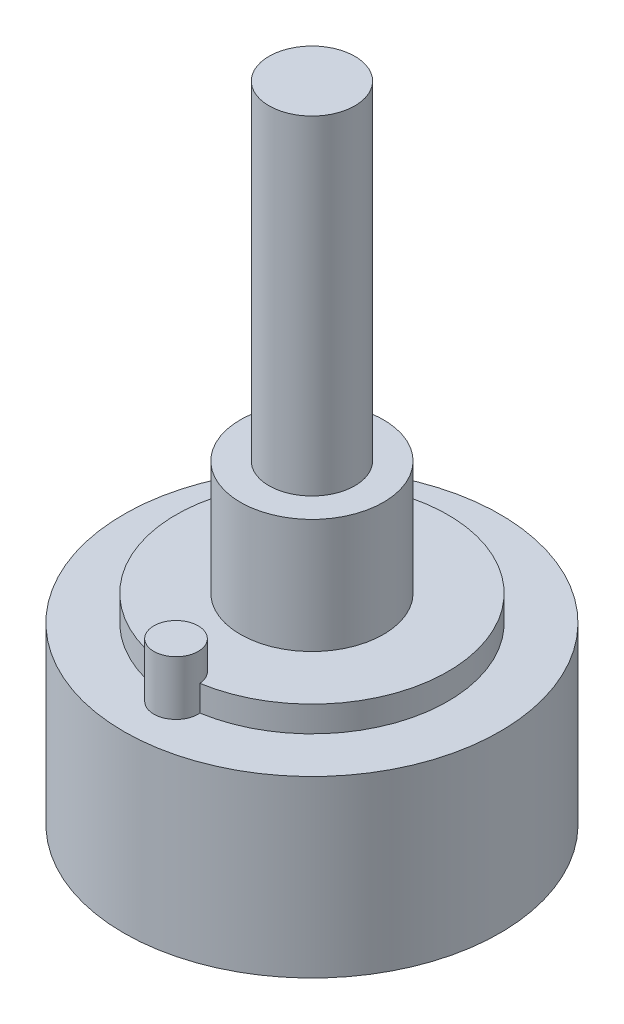
ISO-10303-21;
HEADER;
FILE_DESCRIPTION(('STEP AP214'),'2;1');
FILE_NAME('part.step','',(''),(''),'','','');
FILE_SCHEMA(('AUTOMOTIVE_DESIGN { 1 0 10303 214 1 1 1 1 }'));
ENDSEC;
DATA;
#1=APPLICATION_CONTEXT('core data for automotive mechanical design processes');
#2=APPLICATION_PROTOCOL_DEFINITION('international standard','automotive_design',2000,#1);
#3=PRODUCT_CONTEXT('',#1,'mechanical');
#4=PRODUCT('Part','Part','',(#3));
#5=PRODUCT_RELATED_PRODUCT_CATEGORY('part','',(#4));
#6=PRODUCT_DEFINITION_FORMATION('','',#4);
#7=PRODUCT_DEFINITION_CONTEXT('part definition',#1,'design');
#8=PRODUCT_DEFINITION('design','',#6,#7);
#9=PRODUCT_DEFINITION_SHAPE('','',#8);
#10=(LENGTH_UNIT() NAMED_UNIT(*) SI_UNIT(.MILLI.,.METRE.));
#11=(NAMED_UNIT(*) PLANE_ANGLE_UNIT() SI_UNIT($,.RADIAN.));
#12=(NAMED_UNIT(*) SI_UNIT($,.STERADIAN.) SOLID_ANGLE_UNIT());
#13=UNCERTAINTY_MEASURE_WITH_UNIT(LENGTH_MEASURE(1.E-05),#10,'distance_accuracy_value','');
#14=(GEOMETRIC_REPRESENTATION_CONTEXT(3) GLOBAL_UNCERTAINTY_ASSIGNED_CONTEXT((#13)) GLOBAL_UNIT_ASSIGNED_CONTEXT((#10,
#11,#12)) REPRESENTATION_CONTEXT('',''));
#15=CARTESIAN_POINT('',(0.,0.,0.));
#16=DIRECTION('',(0.,0.,1.));
#17=DIRECTION('',(1.,0.,0.));
#18=AXIS2_PLACEMENT_3D('',#15,#16,#17);
#19=CARTESIAN_POINT('',(0.,14.,0.));
#20=DIRECTION('',(0.,1.,0.));
#21=DIRECTION('',(0.,0.,1.));
#22=AXIS2_PLACEMENT_3D('',#19,#20,#21);
#23=PLANE('',#22);
#24=CARTESIAN_POINT('',(0.,14.,0.));
#25=DIRECTION('',(0.,1.,0.));
#26=DIRECTION('',(0.,0.,1.));
#27=AXIS2_PLACEMENT_3D('',#24,#25,#26);
#28=CIRCLE('',#27,5.);
#29=CARTESIAN_POINT('',(0.,14.,5.));
#30=VERTEX_POINT('',#29);
#31=EDGE_CURVE('E80',#30,#30,#28,.T.);
#32=ORIENTED_EDGE('',*,*,#31,.F.);
#33=EDGE_LOOP('',(#32));
#34=FACE_BOUND('',#33,.T.);
#35=CARTESIAN_POINT('',(0.,14.,0.));
#36=DIRECTION('',(0.,1.,0.));
#37=DIRECTION('',(0.,0.,1.));
#38=AXIS2_PLACEMENT_3D('',#35,#36,#37);
#39=CIRCLE('',#38,9.5);
#40=CARTESIAN_POINT('',(1.54483366839909,14.,9.37355263157895));
#41=VERTEX_POINT('',#40);
#42=CARTESIAN_POINT('',(-1.54483366839909,14.,9.37355263157895));
#43=VERTEX_POINT('',#42);
#44=EDGE_CURVE('E58',#41,#43,#39,.T.);
#45=ORIENTED_EDGE('',*,*,#44,.T.);
#46=CARTESIAN_POINT('',(0.,14.,9.5));
#47=DIRECTION('',(0.,1.,0.));
#48=DIRECTION('',(0.,0.,1.));
#49=AXIS2_PLACEMENT_3D('',#46,#47,#48);
#50=CIRCLE('',#49,1.55);
#51=EDGE_CURVE('E66',#43,#41,#50,.F.);
#52=ORIENTED_EDGE('',*,*,#51,.T.);
#53=EDGE_LOOP('',(#45,#52));
#54=FACE_BOUND('',#53,.T.);
#55=ADVANCED_FACE('F32',(#34,#54),#23,.T.);
#56=CARTESIAN_POINT('',(0.,12.2,0.));
#57=DIRECTION('',(0.,1.,0.));
#58=DIRECTION('',(0.,0.,1.));
#59=AXIS2_PLACEMENT_3D('',#56,#57,#58);
#60=PLANE('',#59);
#61=CARTESIAN_POINT('',(0.,12.2,0.));
#62=DIRECTION('',(0.,1.,0.));
#63=DIRECTION('',(0.,0.,1.));
#64=AXIS2_PLACEMENT_3D('',#61,#62,#63);
#65=CIRCLE('',#64,13.15);
#66=CARTESIAN_POINT('',(0.,12.2,13.15));
#67=VERTEX_POINT('',#66);
#68=EDGE_CURVE('E72',#67,#67,#65,.T.);
#69=ORIENTED_EDGE('',*,*,#68,.T.);
#70=EDGE_LOOP('',(#69));
#71=FACE_BOUND('',#70,.T.);
#72=CARTESIAN_POINT('',(0.,12.2,0.));
#73=DIRECTION('',(0.,1.,0.));
#74=DIRECTION('',(0.,0.,1.));
#75=AXIS2_PLACEMENT_3D('',#72,#73,#74);
#76=CIRCLE('',#75,9.5);
#77=CARTESIAN_POINT('',(1.54483366839909,12.2,9.37355263157895));
#78=VERTEX_POINT('',#77);
#79=CARTESIAN_POINT('',(-1.54483366839909,12.2,9.37355263157895));
#80=VERTEX_POINT('',#79);
#81=EDGE_CURVE('E64',#78,#80,#76,.T.);
#82=ORIENTED_EDGE('',*,*,#81,.F.);
#83=CARTESIAN_POINT('',(0.,12.2,9.5));
#84=DIRECTION('',(0.,1.,0.));
#85=DIRECTION('',(0.,0.,1.));
#86=AXIS2_PLACEMENT_3D('',#83,#84,#85);
#87=CIRCLE('',#86,1.55);
#88=EDGE_CURVE('E46',#80,#78,#87,.T.);
#89=ORIENTED_EDGE('',*,*,#88,.F.);
#90=EDGE_LOOP('',(#82,#89));
#91=FACE_BOUND('',#90,.T.);
#92=ADVANCED_FACE('F108',(#71,#91),#60,.T.);
#93=CARTESIAN_POINT('',(0.,14.,0.));
#94=DIRECTION('',(0.,-1.,0.));
#95=DIRECTION('',(0.,0.,-1.));
#96=AXIS2_PLACEMENT_3D('',#93,#94,#95);
#97=CYLINDRICAL_SURFACE('',#96,9.5);
#98=DIRECTION('',(0.,-1.,0.));
#99=VECTOR('',#98,1.);
#100=CARTESIAN_POINT('',(-1.54483366839909,14.1,9.37355263157895));
#101=LINE('',#100,#99);
#102=EDGE_CURVE('E11',#43,#80,#101,.T.);
#103=ORIENTED_EDGE('',*,*,#102,.F.);
#104=ORIENTED_EDGE('',*,*,#44,.F.);
#105=DIRECTION('',(0.,-1.,0.));
#106=VECTOR('',#105,1.);
#107=CARTESIAN_POINT('',(1.54483366839909,14.1,9.37355263157895));
#108=LINE('',#107,#106);
#109=EDGE_CURVE('E40',#78,#41,#108,.F.);
#110=ORIENTED_EDGE('',*,*,#109,.F.);
#111=ORIENTED_EDGE('',*,*,#81,.T.);
#112=EDGE_LOOP('',(#103,#104,#110,#111));
#113=FACE_BOUND('',#112,.T.);
#114=ADVANCED_FACE('F60',(#113),#97,.T.);
#115=CARTESIAN_POINT('',(0.,22.,0.));
#116=DIRECTION('',(0.,1.,0.));
#117=DIRECTION('',(0.,0.,1.));
#118=AXIS2_PLACEMENT_3D('',#115,#116,#117);
#119=PLANE('',#118);
#120=CARTESIAN_POINT('',(0.,22.,0.));
#121=DIRECTION('',(0.,1.,0.));
#122=DIRECTION('',(0.,0.,1.));
#123=AXIS2_PLACEMENT_3D('',#120,#121,#122);
#124=CIRCLE('',#123,5.);
#125=CARTESIAN_POINT('',(0.,22.,5.));
#126=VERTEX_POINT('',#125);
#127=EDGE_CURVE('E78',#126,#126,#124,.T.);
#128=ORIENTED_EDGE('',*,*,#127,.T.);
#129=EDGE_LOOP('',(#128));
#130=FACE_BOUND('',#129,.T.);
#131=CARTESIAN_POINT('',(0.,22.,0.));
#132=DIRECTION('',(0.,1.,0.));
#133=DIRECTION('',(0.,0.,1.));
#134=AXIS2_PLACEMENT_3D('',#131,#132,#133);
#135=CIRCLE('',#134,3.);
#136=CARTESIAN_POINT('',(0.,22.,3.));
#137=VERTEX_POINT('',#136);
#138=EDGE_CURVE('E68',#137,#137,#135,.T.);
#139=ORIENTED_EDGE('',*,*,#138,.F.);
#140=EDGE_LOOP('',(#139));
#141=FACE_BOUND('',#140,.T.);
#142=ADVANCED_FACE('F122',(#130,#141),#119,.T.);
#143=CARTESIAN_POINT('',(0.,12.2,0.));
#144=DIRECTION('',(0.,-1.,0.));
#145=DIRECTION('',(0.,0.,-1.));
#146=AXIS2_PLACEMENT_3D('',#143,#144,#145);
#147=CYLINDRICAL_SURFACE('',#146,13.15);
#148=ORIENTED_EDGE('',*,*,#68,.F.);
#149=EDGE_LOOP('',(#148));
#150=FACE_BOUND('',#149,.T.);
#151=CARTESIAN_POINT('',(0.,0.,0.));
#152=DIRECTION('',(0.,1.,0.));
#153=DIRECTION('',(0.,0.,1.));
#154=AXIS2_PLACEMENT_3D('',#151,#152,#153);
#155=CIRCLE('',#154,13.15);
#156=CARTESIAN_POINT('',(0.,0.,13.15));
#157=VERTEX_POINT('',#156);
#158=EDGE_CURVE('E63',#157,#157,#155,.T.);
#159=ORIENTED_EDGE('',*,*,#158,.T.);
#160=EDGE_LOOP('',(#159));
#161=FACE_BOUND('',#160,.T.);
#162=ADVANCED_FACE('F34',(#150,#161),#147,.T.);
#163=CARTESIAN_POINT('',(0.,0.,0.));
#164=DIRECTION('',(0.,1.,0.));
#165=DIRECTION('',(0.,0.,1.));
#166=AXIS2_PLACEMENT_3D('',#163,#164,#165);
#167=PLANE('',#166);
#168=ORIENTED_EDGE('',*,*,#158,.F.);
#169=EDGE_LOOP('',(#168));
#170=FACE_BOUND('',#169,.T.);
#171=ADVANCED_FACE('F123',(#170),#167,.F.);
#172=CARTESIAN_POINT('',(0.,22.,0.));
#173=DIRECTION('',(0.,-1.,0.));
#174=DIRECTION('',(0.,0.,-1.));
#175=AXIS2_PLACEMENT_3D('',#172,#173,#174);
#176=CYLINDRICAL_SURFACE('',#175,5.);
#177=ORIENTED_EDGE('',*,*,#127,.F.);
#178=EDGE_LOOP('',(#177));
#179=FACE_BOUND('',#178,.T.);
#180=ORIENTED_EDGE('',*,*,#31,.T.);
#181=EDGE_LOOP('',(#180));
#182=FACE_BOUND('',#181,.T.);
#183=ADVANCED_FACE('F119',(#179,#182),#176,.T.);
#184=CARTESIAN_POINT('',(0.,45.,0.));
#185=DIRECTION('',(0.,-1.,0.));
#186=DIRECTION('',(0.,0.,-1.));
#187=AXIS2_PLACEMENT_3D('',#184,#185,#186);
#188=CYLINDRICAL_SURFACE('',#187,3.);
#189=CARTESIAN_POINT('',(0.,45.,0.));
#190=DIRECTION('',(0.,1.,0.));
#191=DIRECTION('',(0.,0.,1.));
#192=AXIS2_PLACEMENT_3D('',#189,#190,#191);
#193=CIRCLE('',#192,3.);
#194=CARTESIAN_POINT('',(0.,45.,3.));
#195=VERTEX_POINT('',#194);
#196=EDGE_CURVE('E83',#195,#195,#193,.T.);
#197=ORIENTED_EDGE('',*,*,#196,.F.);
#198=EDGE_LOOP('',(#197));
#199=FACE_BOUND('',#198,.T.);
#200=ORIENTED_EDGE('',*,*,#138,.T.);
#201=EDGE_LOOP('',(#200));
#202=FACE_BOUND('',#201,.T.);
#203=ADVANCED_FACE('F104',(#199,#202),#188,.T.);
#204=CARTESIAN_POINT('',(0.,45.,0.));
#205=DIRECTION('',(0.,1.,0.));
#206=DIRECTION('',(0.,0.,1.));
#207=AXIS2_PLACEMENT_3D('',#204,#205,#206);
#208=PLANE('',#207);
#209=ORIENTED_EDGE('',*,*,#196,.T.);
#210=EDGE_LOOP('',(#209));
#211=FACE_BOUND('',#210,.T.);
#212=ADVANCED_FACE('F97',(#211),#208,.T.);
#213=CARTESIAN_POINT('',(0.,16.,9.5));
#214=DIRECTION('',(0.,-1.,0.));
#215=DIRECTION('',(0.,0.,-1.));
#216=AXIS2_PLACEMENT_3D('',#213,#214,#215);
#217=CYLINDRICAL_SURFACE('',#216,1.55);
#218=CARTESIAN_POINT('',(0.,16.,9.5));
#219=DIRECTION('',(0.,1.,0.));
#220=DIRECTION('',(0.,0.,1.));
#221=AXIS2_PLACEMENT_3D('',#218,#219,#220);
#222=CIRCLE('',#221,1.55);
#223=CARTESIAN_POINT('',(0.,16.,11.05));
#224=VERTEX_POINT('',#223);
#225=EDGE_CURVE('E69',#224,#224,#222,.T.);
#226=ORIENTED_EDGE('',*,*,#225,.F.);
#227=EDGE_LOOP('',(#226));
#228=FACE_BOUND('',#227,.T.);
#229=ORIENTED_EDGE('',*,*,#51,.F.);
#230=ORIENTED_EDGE('',*,*,#102,.T.);
#231=ORIENTED_EDGE('',*,*,#88,.T.);
#232=ORIENTED_EDGE('',*,*,#109,.T.);
#233=EDGE_LOOP('',(#229,#230,#231,#232));
#234=FACE_BOUND('',#233,.T.);
#235=ADVANCED_FACE('F71',(#228,#234),#217,.T.);
#236=CARTESIAN_POINT('',(0.,16.,9.5));
#237=DIRECTION('',(0.,1.,0.));
#238=DIRECTION('',(0.,0.,1.));
#239=AXIS2_PLACEMENT_3D('',#236,#237,#238);
#240=PLANE('',#239);
#241=ORIENTED_EDGE('',*,*,#225,.T.);
#242=EDGE_LOOP('',(#241));
#243=FACE_BOUND('',#242,.T.);
#244=ADVANCED_FACE('F94',(#243),#240,.T.);
#245=CLOSED_SHELL('',(#55,#92,#114,#142,#162,#171,#183,#203,#212,#235,#244));
#246=MANIFOLD_SOLID_BREP('B2',#245);
#247=ADVANCED_BREP_SHAPE_REPRESENTATION('',(#18,#246),#14);
#248=SHAPE_DEFINITION_REPRESENTATION(#9,#247);
ENDSEC;
END-ISO-10303-21;
